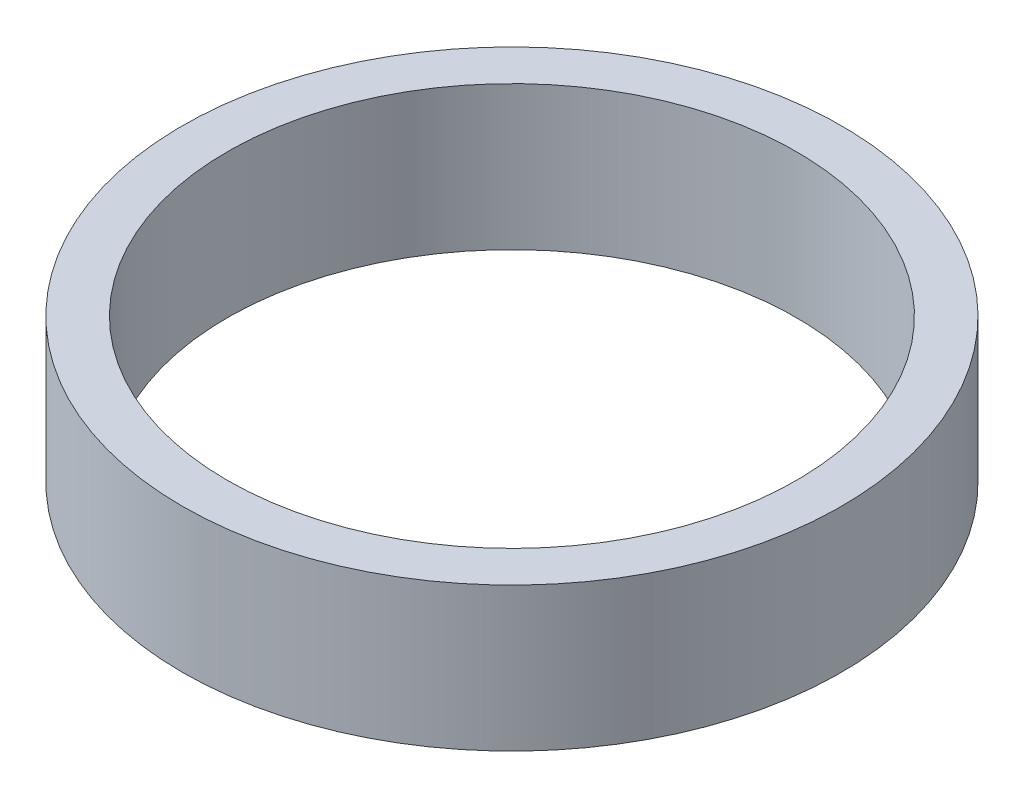
ISO-10303-21;
HEADER;
FILE_DESCRIPTION(('STEP AP214'),'2;1');
FILE_NAME('part.step','',(''),(''),'','','');
FILE_SCHEMA(('AUTOMOTIVE_DESIGN { 1 0 10303 214 1 1 1 1 }'));
ENDSEC;
DATA;
#1=APPLICATION_CONTEXT('core data for automotive mechanical design processes');
#2=APPLICATION_PROTOCOL_DEFINITION('international standard','automotive_design',2000,#1);
#3=PRODUCT_CONTEXT('',#1,'mechanical');
#4=PRODUCT('Part','Part','',(#3));
#5=PRODUCT_RELATED_PRODUCT_CATEGORY('part','',(#4));
#6=PRODUCT_DEFINITION_FORMATION('','',#4);
#7=PRODUCT_DEFINITION_CONTEXT('part definition',#1,'design');
#8=PRODUCT_DEFINITION('design','',#6,#7);
#9=PRODUCT_DEFINITION_SHAPE('','',#8);
#10=(LENGTH_UNIT() NAMED_UNIT(*) SI_UNIT(.MILLI.,.METRE.));
#11=(NAMED_UNIT(*) PLANE_ANGLE_UNIT() SI_UNIT($,.RADIAN.));
#12=(NAMED_UNIT(*) SI_UNIT($,.STERADIAN.) SOLID_ANGLE_UNIT());
#13=UNCERTAINTY_MEASURE_WITH_UNIT(LENGTH_MEASURE(1.E-05),#10,'distance_accuracy_value','');
#14=(GEOMETRIC_REPRESENTATION_CONTEXT(3) GLOBAL_UNCERTAINTY_ASSIGNED_CONTEXT((#13)) GLOBAL_UNIT_ASSIGNED_CONTEXT((#10,
#11,#12)) REPRESENTATION_CONTEXT('',''));
#15=CARTESIAN_POINT('',(0.,0.,0.));
#16=DIRECTION('',(0.,0.,1.));
#17=DIRECTION('',(1.,0.,0.));
#18=AXIS2_PLACEMENT_3D('',#15,#16,#17);
#19=CARTESIAN_POINT('',(0.,24.,0.));
#20=DIRECTION('',(0.,-1.,0.));
#21=DIRECTION('',(0.,0.,-1.));
#22=AXIS2_PLACEMENT_3D('',#19,#20,#21);
#23=CYLINDRICAL_SURFACE('',#22,55.);
#24=CARTESIAN_POINT('',(0.,24.,0.));
#25=DIRECTION('',(0.,1.,0.));
#26=DIRECTION('',(0.,0.,1.));
#27=AXIS2_PLACEMENT_3D('',#24,#25,#26);
#28=CIRCLE('',#27,55.);
#29=CARTESIAN_POINT('',(0.,24.,55.));
#30=VERTEX_POINT('',#29);
#31=EDGE_CURVE('E10',#30,#30,#28,.T.);
#32=ORIENTED_EDGE('',*,*,#31,.F.);
#33=EDGE_LOOP('',(#32));
#34=FACE_BOUND('',#33,.T.);
#35=CARTESIAN_POINT('',(0.,0.,0.));
#36=DIRECTION('',(0.,1.,0.));
#37=DIRECTION('',(0.,0.,1.));
#38=AXIS2_PLACEMENT_3D('',#35,#36,#37);
#39=CIRCLE('',#38,55.);
#40=CARTESIAN_POINT('',(0.,0.,55.));
#41=VERTEX_POINT('',#40);
#42=EDGE_CURVE('E37',#41,#41,#39,.T.);
#43=ORIENTED_EDGE('',*,*,#42,.T.);
#44=EDGE_LOOP('',(#43));
#45=FACE_BOUND('',#44,.T.);
#46=ADVANCED_FACE('F40',(#34,#45),#23,.T.);
#47=CARTESIAN_POINT('',(0.,24.,0.));
#48=DIRECTION('',(0.,1.,0.));
#49=DIRECTION('',(0.,0.,1.));
#50=AXIS2_PLACEMENT_3D('',#47,#48,#49);
#51=PLANE('',#50);
#52=CARTESIAN_POINT('',(0.,24.,0.));
#53=DIRECTION('',(0.,1.,0.));
#54=DIRECTION('',(0.,0.,1.));
#55=AXIS2_PLACEMENT_3D('',#52,#53,#54);
#56=CIRCLE('',#55,47.5);
#57=CARTESIAN_POINT('',(0.,24.,47.5));
#58=VERTEX_POINT('',#57);
#59=EDGE_CURVE('E50',#58,#58,#56,.T.);
#60=ORIENTED_EDGE('',*,*,#59,.F.);
#61=EDGE_LOOP('',(#60));
#62=FACE_BOUND('',#61,.T.);
#63=ORIENTED_EDGE('',*,*,#31,.T.);
#64=EDGE_LOOP('',(#63));
#65=FACE_BOUND('',#64,.T.);
#66=ADVANCED_FACE('F59',(#62,#65),#51,.T.);
#67=CARTESIAN_POINT('',(0.,0.,0.));
#68=DIRECTION('',(0.,1.,0.));
#69=DIRECTION('',(0.,0.,1.));
#70=AXIS2_PLACEMENT_3D('',#67,#68,#69);
#71=PLANE('',#70);
#72=CARTESIAN_POINT('',(0.,0.,0.));
#73=DIRECTION('',(0.,1.,0.));
#74=DIRECTION('',(0.,0.,1.));
#75=AXIS2_PLACEMENT_3D('',#72,#73,#74);
#76=CIRCLE('',#75,47.5);
#77=CARTESIAN_POINT('',(0.,0.,47.5));
#78=VERTEX_POINT('',#77);
#79=EDGE_CURVE('E47',#78,#78,#76,.T.);
#80=ORIENTED_EDGE('',*,*,#79,.T.);
#81=EDGE_LOOP('',(#80));
#82=FACE_BOUND('',#81,.T.);
#83=ORIENTED_EDGE('',*,*,#42,.F.);
#84=EDGE_LOOP('',(#83));
#85=FACE_BOUND('',#84,.T.);
#86=ADVANCED_FACE('F58',(#82,#85),#71,.F.);
#87=CARTESIAN_POINT('',(0.,24.,0.));
#88=DIRECTION('',(0.,-1.,0.));
#89=DIRECTION('',(0.,0.,-1.));
#90=AXIS2_PLACEMENT_3D('',#87,#88,#89);
#91=CYLINDRICAL_SURFACE('',#90,47.5);
#92=ORIENTED_EDGE('',*,*,#59,.T.);
#93=EDGE_LOOP('',(#92));
#94=FACE_BOUND('',#93,.T.);
#95=ORIENTED_EDGE('',*,*,#79,.F.);
#96=EDGE_LOOP('',(#95));
#97=FACE_BOUND('',#96,.T.);
#98=ADVANCED_FACE('F54',(#94,#97),#91,.F.);
#99=CLOSED_SHELL('',(#46,#66,#86,#98));
#100=MANIFOLD_SOLID_BREP('B2',#99);
#101=ADVANCED_BREP_SHAPE_REPRESENTATION('',(#18,#100),#14);
#102=SHAPE_DEFINITION_REPRESENTATION(#9,#101);
ENDSEC;
END-ISO-10303-21;
